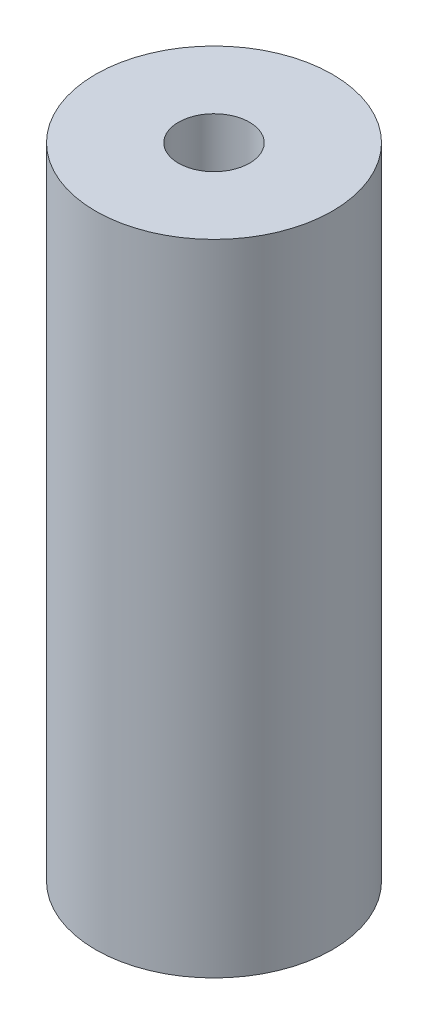
ISO-10303-21;
HEADER;
FILE_DESCRIPTION(('STEP AP214'),'2;1');
FILE_NAME('part.step','',(''),(''),'','','');
FILE_SCHEMA(('AUTOMOTIVE_DESIGN { 1 0 10303 214 1 1 1 1 }'));
ENDSEC;
DATA;
#1=APPLICATION_CONTEXT('core data for automotive mechanical design processes');
#2=APPLICATION_PROTOCOL_DEFINITION('international standard','automotive_design',2000,#1);
#3=PRODUCT_CONTEXT('',#1,'mechanical');
#4=PRODUCT('Part','Part','',(#3));
#5=PRODUCT_RELATED_PRODUCT_CATEGORY('part','',(#4));
#6=PRODUCT_DEFINITION_FORMATION('','',#4);
#7=PRODUCT_DEFINITION_CONTEXT('part definition',#1,'design');
#8=PRODUCT_DEFINITION('design','',#6,#7);
#9=PRODUCT_DEFINITION_SHAPE('','',#8);
#10=(LENGTH_UNIT() NAMED_UNIT(*) SI_UNIT(.MILLI.,.METRE.));
#11=(NAMED_UNIT(*) PLANE_ANGLE_UNIT() SI_UNIT($,.RADIAN.));
#12=(NAMED_UNIT(*) SI_UNIT($,.STERADIAN.) SOLID_ANGLE_UNIT());
#13=UNCERTAINTY_MEASURE_WITH_UNIT(LENGTH_MEASURE(1.E-05),#10,'distance_accuracy_value','');
#14=(GEOMETRIC_REPRESENTATION_CONTEXT(3) GLOBAL_UNCERTAINTY_ASSIGNED_CONTEXT((#13)) GLOBAL_UNIT_ASSIGNED_CONTEXT((#10,
#11,#12)) REPRESENTATION_CONTEXT('',''));
#15=CARTESIAN_POINT('',(0.,0.,0.));
#16=DIRECTION('',(0.,0.,1.));
#17=DIRECTION('',(1.,0.,0.));
#18=AXIS2_PLACEMENT_3D('',#15,#16,#17);
#19=CARTESIAN_POINT('',(0.,27.,0.));
#20=DIRECTION('',(0.,-1.,0.));
#21=DIRECTION('',(0.,0.,-1.));
#22=AXIS2_PLACEMENT_3D('',#19,#20,#21);
#23=CYLINDRICAL_SURFACE('',#22,5.);
#24=CARTESIAN_POINT('',(0.,27.,0.));
#25=DIRECTION('',(0.,1.,0.));
#26=DIRECTION('',(0.,0.,1.));
#27=AXIS2_PLACEMENT_3D('',#24,#25,#26);
#28=CIRCLE('',#27,5.);
#29=CARTESIAN_POINT('',(0.,27.,5.));
#30=VERTEX_POINT('',#29);
#31=EDGE_CURVE('E10',#30,#30,#28,.T.);
#32=ORIENTED_EDGE('',*,*,#31,.F.);
#33=EDGE_LOOP('',(#32));
#34=FACE_BOUND('',#33,.T.);
#35=CARTESIAN_POINT('',(0.,0.,0.));
#36=DIRECTION('',(0.,1.,0.));
#37=DIRECTION('',(0.,0.,1.));
#38=AXIS2_PLACEMENT_3D('',#35,#36,#37);
#39=CIRCLE('',#38,5.);
#40=CARTESIAN_POINT('',(0.,0.,5.));
#41=VERTEX_POINT('',#40);
#42=EDGE_CURVE('E34',#41,#41,#39,.T.);
#43=ORIENTED_EDGE('',*,*,#42,.T.);
#44=EDGE_LOOP('',(#43));
#45=FACE_BOUND('',#44,.T.);
#46=ADVANCED_FACE('F31',(#34,#45),#23,.T.);
#47=CARTESIAN_POINT('',(0.,27.,0.));
#48=DIRECTION('',(0.,1.,0.));
#49=DIRECTION('',(0.,0.,1.));
#50=AXIS2_PLACEMENT_3D('',#47,#48,#49);
#51=PLANE('',#50);
#52=CARTESIAN_POINT('',(0.,27.,0.));
#53=DIRECTION('',(0.,1.,0.));
#54=DIRECTION('',(0.,0.,1.));
#55=AXIS2_PLACEMENT_3D('',#52,#53,#54);
#56=CIRCLE('',#55,1.5);
#57=CARTESIAN_POINT('',(0.,27.,1.5));
#58=VERTEX_POINT('',#57);
#59=EDGE_CURVE('E43',#58,#58,#56,.T.);
#60=ORIENTED_EDGE('',*,*,#59,.F.);
#61=EDGE_LOOP('',(#60));
#62=FACE_BOUND('',#61,.T.);
#63=ORIENTED_EDGE('',*,*,#31,.T.);
#64=EDGE_LOOP('',(#63));
#65=FACE_BOUND('',#64,.T.);
#66=ADVANCED_FACE('F68',(#62,#65),#51,.T.);
#67=CARTESIAN_POINT('',(0.,0.,0.));
#68=DIRECTION('',(0.,1.,0.));
#69=DIRECTION('',(0.,0.,1.));
#70=AXIS2_PLACEMENT_3D('',#67,#68,#69);
#71=PLANE('',#70);
#72=CARTESIAN_POINT('',(0.,0.,0.));
#73=DIRECTION('',(0.,-1.,0.));
#74=DIRECTION('',(0.,0.,-1.));
#75=AXIS2_PLACEMENT_3D('',#72,#73,#74);
#76=CIRCLE('',#75,1.5);
#77=CARTESIAN_POINT('',(0.,0.,-1.5));
#78=VERTEX_POINT('',#77);
#79=EDGE_CURVE('E49',#78,#78,#76,.T.);
#80=ORIENTED_EDGE('',*,*,#79,.F.);
#81=EDGE_LOOP('',(#80));
#82=FACE_BOUND('',#81,.T.);
#83=ORIENTED_EDGE('',*,*,#42,.F.);
#84=EDGE_LOOP('',(#83));
#85=FACE_BOUND('',#84,.T.);
#86=ADVANCED_FACE('F64',(#82,#85),#71,.F.);
#87=CARTESIAN_POINT('',(0.,22.,0.));
#88=DIRECTION('',(0.,1.,0.));
#89=DIRECTION('',(0.,0.,1.));
#90=AXIS2_PLACEMENT_3D('',#87,#88,#89);
#91=CYLINDRICAL_SURFACE('',#90,1.5);
#92=CARTESIAN_POINT('',(0.,22.,0.));
#93=DIRECTION('',(0.,1.,0.));
#94=DIRECTION('',(0.,0.,1.));
#95=AXIS2_PLACEMENT_3D('',#92,#93,#94);
#96=CIRCLE('',#95,1.5);
#97=CARTESIAN_POINT('',(0.,22.,1.5));
#98=VERTEX_POINT('',#97);
#99=EDGE_CURVE('E41',#98,#98,#96,.T.);
#100=ORIENTED_EDGE('',*,*,#99,.F.);
#101=EDGE_LOOP('',(#100));
#102=FACE_BOUND('',#101,.T.);
#103=ORIENTED_EDGE('',*,*,#59,.T.);
#104=EDGE_LOOP('',(#103));
#105=FACE_BOUND('',#104,.T.);
#106=ADVANCED_FACE('F67',(#102,#105),#91,.F.);
#107=CARTESIAN_POINT('',(0.,22.,0.));
#108=DIRECTION('',(0.,1.,0.));
#109=DIRECTION('',(0.,0.,1.));
#110=AXIS2_PLACEMENT_3D('',#107,#108,#109);
#111=PLANE('',#110);
#112=ORIENTED_EDGE('',*,*,#99,.T.);
#113=EDGE_LOOP('',(#112));
#114=FACE_BOUND('',#113,.T.);
#115=ADVANCED_FACE('F60',(#114),#111,.T.);
#116=CARTESIAN_POINT('',(0.,5.,0.));
#117=DIRECTION('',(0.,-1.,0.));
#118=DIRECTION('',(0.,0.,-1.));
#119=AXIS2_PLACEMENT_3D('',#116,#117,#118);
#120=CYLINDRICAL_SURFACE('',#119,1.5);
#121=CARTESIAN_POINT('',(0.,5.,0.));
#122=DIRECTION('',(0.,-1.,0.));
#123=DIRECTION('',(0.,0.,-1.));
#124=AXIS2_PLACEMENT_3D('',#121,#122,#123);
#125=CIRCLE('',#124,1.5);
#126=CARTESIAN_POINT('',(0.,5.,-1.5));
#127=VERTEX_POINT('',#126);
#128=EDGE_CURVE('E46',#127,#127,#125,.T.);
#129=ORIENTED_EDGE('',*,*,#128,.F.);
#130=EDGE_LOOP('',(#129));
#131=FACE_BOUND('',#130,.T.);
#132=ORIENTED_EDGE('',*,*,#79,.T.);
#133=EDGE_LOOP('',(#132));
#134=FACE_BOUND('',#133,.T.);
#135=ADVANCED_FACE('F57',(#131,#134),#120,.F.);
#136=CARTESIAN_POINT('',(0.,5.,0.));
#137=DIRECTION('',(0.,-1.,0.));
#138=DIRECTION('',(0.,0.,-1.));
#139=AXIS2_PLACEMENT_3D('',#136,#137,#138);
#140=PLANE('',#139);
#141=ORIENTED_EDGE('',*,*,#128,.T.);
#142=EDGE_LOOP('',(#141));
#143=FACE_BOUND('',#142,.T.);
#144=ADVANCED_FACE('F55',(#143),#140,.T.);
#145=CLOSED_SHELL('',(#46,#66,#86,#106,#115,#135,#144));
#146=MANIFOLD_SOLID_BREP('B2',#145);
#147=ADVANCED_BREP_SHAPE_REPRESENTATION('',(#18,#146),#14);
#148=SHAPE_DEFINITION_REPRESENTATION(#9,#147);
ENDSEC;
END-ISO-10303-21;
